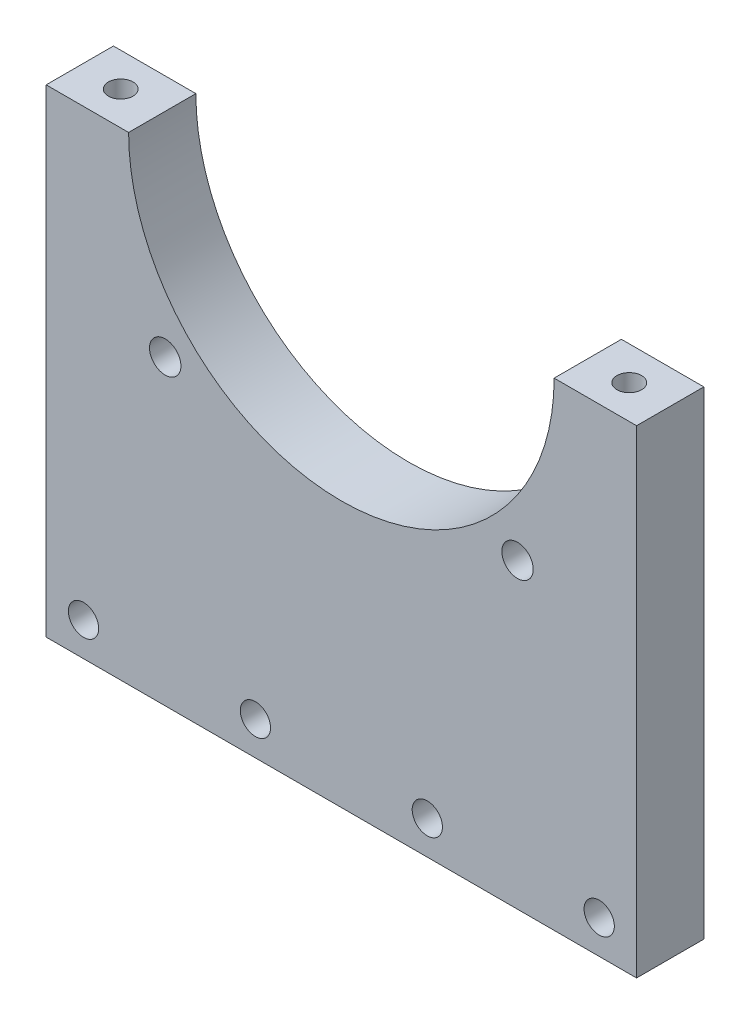
ISO-10303-21;
HEADER;
FILE_DESCRIPTION(('STEP AP214'),'2;1');
FILE_NAME('part.step','',(''),(''),'','','');
FILE_SCHEMA(('AUTOMOTIVE_DESIGN { 1 0 10303 214 1 1 1 1 }'));
ENDSEC;
DATA;
#1=APPLICATION_CONTEXT('core data for automotive mechanical design processes');
#2=APPLICATION_PROTOCOL_DEFINITION('international standard','automotive_design',2000,#1);
#3=PRODUCT_CONTEXT('',#1,'mechanical');
#4=PRODUCT('Part','Part','',(#3));
#5=PRODUCT_RELATED_PRODUCT_CATEGORY('part','',(#4));
#6=PRODUCT_DEFINITION_FORMATION('','',#4);
#7=PRODUCT_DEFINITION_CONTEXT('part definition',#1,'design');
#8=PRODUCT_DEFINITION('design','',#6,#7);
#9=PRODUCT_DEFINITION_SHAPE('','',#8);
#10=(LENGTH_UNIT() NAMED_UNIT(*) SI_UNIT(.MILLI.,.METRE.));
#11=(NAMED_UNIT(*) PLANE_ANGLE_UNIT() SI_UNIT($,.RADIAN.));
#12=(NAMED_UNIT(*) SI_UNIT($,.STERADIAN.) SOLID_ANGLE_UNIT());
#13=UNCERTAINTY_MEASURE_WITH_UNIT(LENGTH_MEASURE(1.E-05),#10,'distance_accuracy_value','');
#14=(GEOMETRIC_REPRESENTATION_CONTEXT(3) GLOBAL_UNCERTAINTY_ASSIGNED_CONTEXT((#13)) GLOBAL_UNIT_ASSIGNED_CONTEXT((#10,
#11,#12)) REPRESENTATION_CONTEXT('',''));
#15=CARTESIAN_POINT('',(0.,0.,0.));
#16=DIRECTION('',(0.,0.,1.));
#17=DIRECTION('',(1.,0.,0.));
#18=AXIS2_PLACEMENT_3D('',#15,#16,#17);
#19=CARTESIAN_POINT('',(0.,-20.,4.5));
#20=DIRECTION('',(0.,1.,0.));
#21=DIRECTION('',(1.,0.,0.));
#22=AXIS2_PLACEMENT_3D('',#19,#20,#21);
#23=PLANE('',#22);
#24=CARTESIAN_POINT('',(34.025,-20.,4.5));
#25=DIRECTION('',(0.,1.,0.));
#26=DIRECTION('',(-1.,0.,0.));
#27=AXIS2_PLACEMENT_3D('',#24,#25,#26);
#28=CIRCLE('',#27,1.65);
#29=CARTESIAN_POINT('',(32.375,-20.,4.5));
#30=VERTEX_POINT('',#29);
#31=EDGE_CURVE('E11',#30,#30,#28,.T.);
#32=ORIENTED_EDGE('',*,*,#31,.T.);
#33=EDGE_LOOP('',(#32));
#34=FACE_BOUND('',#33,.T.);
#35=ADVANCED_FACE('F16',(#34),#23,.T.);
#36=CARTESIAN_POINT('',(34.025,-20.,4.5));
#37=DIRECTION('',(0.,1.,0.));
#38=DIRECTION('',(-1.,0.,0.));
#39=AXIS2_PLACEMENT_3D('',#36,#37,#38);
#40=CYLINDRICAL_SURFACE('',#39,1.65);
#41=CARTESIAN_POINT('',(34.025,0.,4.5));
#42=DIRECTION('',(0.,1.,0.));
#43=DIRECTION('',(-1.,0.,0.));
#44=AXIS2_PLACEMENT_3D('',#41,#42,#43);
#45=CIRCLE('',#44,1.65);
#46=CARTESIAN_POINT('',(32.375,0.,4.5));
#47=VERTEX_POINT('',#46);
#48=EDGE_CURVE('E159',#47,#47,#45,.T.);
#49=ORIENTED_EDGE('',*,*,#48,.T.);
#50=EDGE_LOOP('',(#49));
#51=FACE_BOUND('',#50,.T.);
#52=ORIENTED_EDGE('',*,*,#31,.F.);
#53=EDGE_LOOP('',(#52));
#54=FACE_BOUND('',#53,.T.);
#55=ADVANCED_FACE('F350',(#51,#54),#40,.F.);
#56=CARTESIAN_POINT('',(0.,-20.,4.5));
#57=DIRECTION('',(0.,1.,0.));
#58=DIRECTION('',(1.,0.,0.));
#59=AXIS2_PLACEMENT_3D('',#56,#57,#58);
#60=PLANE('',#59);
#61=CARTESIAN_POINT('',(-34.025,-20.,4.5));
#62=DIRECTION('',(0.,1.,0.));
#63=DIRECTION('',(-1.,0.,0.));
#64=AXIS2_PLACEMENT_3D('',#61,#62,#63);
#65=CIRCLE('',#64,1.65);
#66=CARTESIAN_POINT('',(-35.675,-20.,4.5));
#67=VERTEX_POINT('',#66);
#68=EDGE_CURVE('E26',#67,#67,#65,.T.);
#69=ORIENTED_EDGE('',*,*,#68,.T.);
#70=EDGE_LOOP('',(#69));
#71=FACE_BOUND('',#70,.T.);
#72=ADVANCED_FACE('F366',(#71),#60,.T.);
#73=CARTESIAN_POINT('',(-34.025,-20.,4.5));
#74=DIRECTION('',(0.,1.,0.));
#75=DIRECTION('',(-1.,0.,0.));
#76=AXIS2_PLACEMENT_3D('',#73,#74,#75);
#77=CYLINDRICAL_SURFACE('',#76,1.65);
#78=CARTESIAN_POINT('',(-34.025,0.,4.5));
#79=DIRECTION('',(0.,1.,0.));
#80=DIRECTION('',(-1.,0.,0.));
#81=AXIS2_PLACEMENT_3D('',#78,#79,#80);
#82=CIRCLE('',#81,1.65);
#83=CARTESIAN_POINT('',(-35.675,0.,4.5));
#84=VERTEX_POINT('',#83);
#85=EDGE_CURVE('E174',#84,#84,#82,.T.);
#86=ORIENTED_EDGE('',*,*,#85,.T.);
#87=EDGE_LOOP('',(#86));
#88=FACE_BOUND('',#87,.T.);
#89=ORIENTED_EDGE('',*,*,#68,.F.);
#90=EDGE_LOOP('',(#89));
#91=FACE_BOUND('',#90,.T.);
#92=ADVANCED_FACE('F370',(#88,#91),#77,.F.);
#93=CARTESIAN_POINT('',(0.,-12.25,0.));
#94=DIRECTION('',(0.,0.,1.));
#95=DIRECTION('',(1.,0.,0.));
#96=AXIS2_PLACEMENT_3D('',#93,#94,#95);
#97=PLANE('',#96);
#98=CARTESIAN_POINT('',(11.5,-59.5,0.));
#99=DIRECTION('',(0.,0.,1.));
#100=DIRECTION('',(1.,0.,0.));
#101=AXIS2_PLACEMENT_3D('',#98,#99,#100);
#102=CIRCLE('',#101,2.025);
#103=CARTESIAN_POINT('',(13.525,-59.5,0.));
#104=VERTEX_POINT('',#103);
#105=EDGE_CURVE('E215',#104,#104,#102,.T.);
#106=ORIENTED_EDGE('',*,*,#105,.T.);
#107=EDGE_LOOP('',(#106));
#108=FACE_BOUND('',#107,.T.);
#109=CARTESIAN_POINT('',(-34.5,-59.5,0.));
#110=DIRECTION('',(0.,0.,1.));
#111=DIRECTION('',(1.,0.,0.));
#112=AXIS2_PLACEMENT_3D('',#109,#110,#111);
#113=CIRCLE('',#112,2.025);
#114=CARTESIAN_POINT('',(-32.475,-59.5,0.));
#115=VERTEX_POINT('',#114);
#116=EDGE_CURVE('E144',#115,#115,#113,.T.);
#117=ORIENTED_EDGE('',*,*,#116,.T.);
#118=EDGE_LOOP('',(#117));
#119=FACE_BOUND('',#118,.T.);
#120=CARTESIAN_POINT('',(34.5,-59.5,0.));
#121=DIRECTION('',(0.,0.,1.));
#122=DIRECTION('',(1.,0.,0.));
#123=AXIS2_PLACEMENT_3D('',#120,#121,#122);
#124=CIRCLE('',#123,2.025);
#125=CARTESIAN_POINT('',(36.525,-59.5,0.));
#126=VERTEX_POINT('',#125);
#127=EDGE_CURVE('E170',#126,#126,#124,.T.);
#128=ORIENTED_EDGE('',*,*,#127,.T.);
#129=EDGE_LOOP('',(#128));
#130=FACE_BOUND('',#129,.T.);
#131=CARTESIAN_POINT('',(-11.5,-59.5,0.));
#132=DIRECTION('',(0.,0.,-1.));
#133=DIRECTION('',(1.,0.,0.));
#134=AXIS2_PLACEMENT_3D('',#131,#132,#133);
#135=CIRCLE('',#134,2.025);
#136=CARTESIAN_POINT('',(-9.475,-59.5,0.));
#137=VERTEX_POINT('',#136);
#138=EDGE_CURVE('E169',#137,#137,#135,.T.);
#139=ORIENTED_EDGE('',*,*,#138,.F.);
#140=EDGE_LOOP('',(#139));
#141=FACE_BOUND('',#140,.T.);
#142=DIRECTION('',(0.,-1.,0.));
#143=VECTOR('',#142,1.);
#144=CARTESIAN_POINT('',(-39.5,-27.5,0.));
#145=LINE('',#144,#143);
#146=CARTESIAN_POINT('',(-39.5,0.,0.));
#147=VERTEX_POINT('',#146);
#148=CARTESIAN_POINT('',(-39.5,-64.,0.));
#149=VERTEX_POINT('',#148);
#150=EDGE_CURVE('E237',#147,#149,#145,.T.);
#151=ORIENTED_EDGE('',*,*,#150,.F.);
#152=DIRECTION('',(1.,0.,0.));
#153=VECTOR('',#152,1.);
#154=CARTESIAN_POINT('',(-34.025,0.,0.));
#155=LINE('',#154,#153);
#156=CARTESIAN_POINT('',(-28.47,0.,0.));
#157=VERTEX_POINT('',#156);
#158=EDGE_CURVE('E175',#147,#157,#155,.T.);
#159=ORIENTED_EDGE('',*,*,#158,.T.);
#160=CARTESIAN_POINT('',(0.,0.,0.));
#161=DIRECTION('',(0.,0.,1.));
#162=DIRECTION('',(1.,0.,0.));
#163=AXIS2_PLACEMENT_3D('',#160,#161,#162);
#164=CIRCLE('',#163,28.47);
#165=CARTESIAN_POINT('',(28.47,0.,0.));
#166=VERTEX_POINT('',#165);
#167=EDGE_CURVE('E204',#157,#166,#164,.T.);
#168=ORIENTED_EDGE('',*,*,#167,.T.);
#169=DIRECTION('',(-1.,0.,0.));
#170=VECTOR('',#169,1.);
#171=CARTESIAN_POINT('',(34.025,0.,0.));
#172=LINE('',#171,#170);
#173=CARTESIAN_POINT('',(39.5,0.,0.));
#174=VERTEX_POINT('',#173);
#175=EDGE_CURVE('E193',#174,#166,#172,.T.);
#176=ORIENTED_EDGE('',*,*,#175,.F.);
#177=DIRECTION('',(0.,1.,0.));
#178=VECTOR('',#177,1.);
#179=CARTESIAN_POINT('',(39.5,-27.5,0.));
#180=LINE('',#179,#178);
#181=CARTESIAN_POINT('',(39.5,-64.,0.));
#182=VERTEX_POINT('',#181);
#183=EDGE_CURVE('E161',#182,#174,#180,.T.);
#184=ORIENTED_EDGE('',*,*,#183,.F.);
#185=DIRECTION('',(-1.,0.,0.));
#186=VECTOR('',#185,1.);
#187=CARTESIAN_POINT('',(0.,-64.,0.));
#188=LINE('',#187,#186);
#189=EDGE_CURVE('E203',#182,#149,#188,.T.);
#190=ORIENTED_EDGE('',*,*,#189,.T.);
#191=EDGE_LOOP('',(#151,#159,#168,#176,#184,#190));
#192=FACE_BOUND('',#191,.T.);
#193=CARTESIAN_POINT('',(-23.57,-23.57,0.));
#194=DIRECTION('',(0.,0.,1.));
#195=DIRECTION('',(1.,0.,0.));
#196=AXIS2_PLACEMENT_3D('',#193,#194,#195);
#197=CIRCLE('',#196,2.1);
#198=CARTESIAN_POINT('',(-21.47,-23.57,0.));
#199=VERTEX_POINT('',#198);
#200=EDGE_CURVE('E176',#199,#199,#197,.T.);
#201=ORIENTED_EDGE('',*,*,#200,.T.);
#202=EDGE_LOOP('',(#201));
#203=FACE_BOUND('',#202,.T.);
#204=CARTESIAN_POINT('',(23.57,-23.57,0.));
#205=DIRECTION('',(0.,0.,1.));
#206=DIRECTION('',(1.,0.,0.));
#207=AXIS2_PLACEMENT_3D('',#204,#205,#206);
#208=CIRCLE('',#207,2.1);
#209=CARTESIAN_POINT('',(25.67,-23.57,0.));
#210=VERTEX_POINT('',#209);
#211=EDGE_CURVE('E207',#210,#210,#208,.T.);
#212=ORIENTED_EDGE('',*,*,#211,.T.);
#213=EDGE_LOOP('',(#212));
#214=FACE_BOUND('',#213,.T.);
#215=ADVANCED_FACE('F263',(#108,#119,#130,#141,#192,#203,#214),#97,.F.);
#216=CARTESIAN_POINT('',(0.,-12.25,9.));
#217=DIRECTION('',(0.,0.,1.));
#218=DIRECTION('',(1.,0.,0.));
#219=AXIS2_PLACEMENT_3D('',#216,#217,#218);
#220=PLANE('',#219);
#221=CARTESIAN_POINT('',(11.5,-59.5,9.));
#222=DIRECTION('',(0.,0.,1.));
#223=DIRECTION('',(1.,0.,0.));
#224=AXIS2_PLACEMENT_3D('',#221,#222,#223);
#225=CIRCLE('',#224,2.025);
#226=CARTESIAN_POINT('',(13.525,-59.5,9.));
#227=VERTEX_POINT('',#226);
#228=EDGE_CURVE('E210',#227,#227,#225,.T.);
#229=ORIENTED_EDGE('',*,*,#228,.F.);
#230=EDGE_LOOP('',(#229));
#231=FACE_BOUND('',#230,.T.);
#232=CARTESIAN_POINT('',(-34.5,-59.5,9.));
#233=DIRECTION('',(0.,0.,1.));
#234=DIRECTION('',(1.,0.,0.));
#235=AXIS2_PLACEMENT_3D('',#232,#233,#234);
#236=CIRCLE('',#235,2.025);
#237=CARTESIAN_POINT('',(-32.475,-59.5,9.));
#238=VERTEX_POINT('',#237);
#239=EDGE_CURVE('E140',#238,#238,#236,.T.);
#240=ORIENTED_EDGE('',*,*,#239,.F.);
#241=EDGE_LOOP('',(#240));
#242=FACE_BOUND('',#241,.T.);
#243=CARTESIAN_POINT('',(34.5,-59.5,9.));
#244=DIRECTION('',(0.,0.,1.));
#245=DIRECTION('',(1.,0.,0.));
#246=AXIS2_PLACEMENT_3D('',#243,#244,#245);
#247=CIRCLE('',#246,2.025);
#248=CARTESIAN_POINT('',(36.525,-59.5,9.));
#249=VERTEX_POINT('',#248);
#250=EDGE_CURVE('E152',#249,#249,#247,.T.);
#251=ORIENTED_EDGE('',*,*,#250,.F.);
#252=EDGE_LOOP('',(#251));
#253=FACE_BOUND('',#252,.T.);
#254=CARTESIAN_POINT('',(-11.5,-59.5,9.));
#255=DIRECTION('',(0.,0.,-1.));
#256=DIRECTION('',(1.,0.,0.));
#257=AXIS2_PLACEMENT_3D('',#254,#255,#256);
#258=CIRCLE('',#257,2.025);
#259=CARTESIAN_POINT('',(-9.475,-59.5,9.));
#260=VERTEX_POINT('',#259);
#261=EDGE_CURVE('E166',#260,#260,#258,.T.);
#262=ORIENTED_EDGE('',*,*,#261,.T.);
#263=EDGE_LOOP('',(#262));
#264=FACE_BOUND('',#263,.T.);
#265=DIRECTION('',(0.,-1.,0.));
#266=VECTOR('',#265,1.);
#267=CARTESIAN_POINT('',(-39.5,-27.5,9.));
#268=LINE('',#267,#266);
#269=CARTESIAN_POINT('',(-39.5,0.,9.));
#270=VERTEX_POINT('',#269);
#271=CARTESIAN_POINT('',(-39.5,-64.,9.));
#272=VERTEX_POINT('',#271);
#273=EDGE_CURVE('E183',#270,#272,#268,.T.);
#274=ORIENTED_EDGE('',*,*,#273,.T.);
#275=DIRECTION('',(-1.,0.,0.));
#276=VECTOR('',#275,1.);
#277=CARTESIAN_POINT('',(0.,-64.,9.));
#278=LINE('',#277,#276);
#279=CARTESIAN_POINT('',(39.5,-64.,9.));
#280=VERTEX_POINT('',#279);
#281=EDGE_CURVE('E164',#280,#272,#278,.T.);
#282=ORIENTED_EDGE('',*,*,#281,.F.);
#283=DIRECTION('',(0.,1.,0.));
#284=VECTOR('',#283,1.);
#285=CARTESIAN_POINT('',(39.5,-27.5,9.));
#286=LINE('',#285,#284);
#287=CARTESIAN_POINT('',(39.5,0.,9.));
#288=VERTEX_POINT('',#287);
#289=EDGE_CURVE('E189',#280,#288,#286,.T.);
#290=ORIENTED_EDGE('',*,*,#289,.T.);
#291=DIRECTION('',(-1.,0.,0.));
#292=VECTOR('',#291,1.);
#293=CARTESIAN_POINT('',(34.025,0.,9.));
#294=LINE('',#293,#292);
#295=CARTESIAN_POINT('',(28.47,0.,9.));
#296=VERTEX_POINT('',#295);
#297=EDGE_CURVE('E194',#288,#296,#294,.T.);
#298=ORIENTED_EDGE('',*,*,#297,.T.);
#299=CARTESIAN_POINT('',(0.,0.,9.));
#300=DIRECTION('',(0.,0.,1.));
#301=DIRECTION('',(1.,0.,0.));
#302=AXIS2_PLACEMENT_3D('',#299,#300,#301);
#303=CIRCLE('',#302,28.47);
#304=CARTESIAN_POINT('',(-28.47,0.,9.));
#305=VERTEX_POINT('',#304);
#306=EDGE_CURVE('E145',#305,#296,#303,.T.);
#307=ORIENTED_EDGE('',*,*,#306,.F.);
#308=DIRECTION('',(1.,0.,0.));
#309=VECTOR('',#308,1.);
#310=CARTESIAN_POINT('',(-34.025,0.,9.));
#311=LINE('',#310,#309);
#312=EDGE_CURVE('E171',#270,#305,#311,.T.);
#313=ORIENTED_EDGE('',*,*,#312,.F.);
#314=EDGE_LOOP('',(#274,#282,#290,#298,#307,#313));
#315=FACE_BOUND('',#314,.T.);
#316=CARTESIAN_POINT('',(-23.57,-23.57,9.));
#317=DIRECTION('',(0.,0.,1.));
#318=DIRECTION('',(1.,0.,0.));
#319=AXIS2_PLACEMENT_3D('',#316,#317,#318);
#320=CIRCLE('',#319,2.1);
#321=CARTESIAN_POINT('',(-21.47,-23.57,9.));
#322=VERTEX_POINT('',#321);
#323=EDGE_CURVE('E179',#322,#322,#320,.T.);
#324=ORIENTED_EDGE('',*,*,#323,.F.);
#325=EDGE_LOOP('',(#324));
#326=FACE_BOUND('',#325,.T.);
#327=CARTESIAN_POINT('',(23.57,-23.57,9.));
#328=DIRECTION('',(0.,0.,1.));
#329=DIRECTION('',(1.,0.,0.));
#330=AXIS2_PLACEMENT_3D('',#327,#328,#329);
#331=CIRCLE('',#330,2.1);
#332=CARTESIAN_POINT('',(25.67,-23.57,9.));
#333=VERTEX_POINT('',#332);
#334=EDGE_CURVE('E178',#333,#333,#331,.T.);
#335=ORIENTED_EDGE('',*,*,#334,.F.);
#336=EDGE_LOOP('',(#335));
#337=FACE_BOUND('',#336,.T.);
#338=ADVANCED_FACE('F271',(#231,#242,#253,#264,#315,#326,#337),#220,.T.);
#339=CARTESIAN_POINT('',(11.5,-59.5,9.));
#340=DIRECTION('',(0.,0.,-1.));
#341=DIRECTION('',(-1.,0.,0.));
#342=AXIS2_PLACEMENT_3D('',#339,#340,#341);
#343=CYLINDRICAL_SURFACE('',#342,2.025);
#344=ORIENTED_EDGE('',*,*,#105,.F.);
#345=EDGE_LOOP('',(#344));
#346=FACE_BOUND('',#345,.T.);
#347=ORIENTED_EDGE('',*,*,#228,.T.);
#348=EDGE_LOOP('',(#347));
#349=FACE_BOUND('',#348,.T.);
#350=ADVANCED_FACE('F384',(#346,#349),#343,.F.);
#351=CARTESIAN_POINT('',(23.57,-23.57,9.));
#352=DIRECTION('',(0.,0.,-1.));
#353=DIRECTION('',(-1.,0.,0.));
#354=AXIS2_PLACEMENT_3D('',#351,#352,#353);
#355=CYLINDRICAL_SURFACE('',#354,2.1);
#356=ORIENTED_EDGE('',*,*,#211,.F.);
#357=EDGE_LOOP('',(#356));
#358=FACE_BOUND('',#357,.T.);
#359=ORIENTED_EDGE('',*,*,#334,.T.);
#360=EDGE_LOOP('',(#359));
#361=FACE_BOUND('',#360,.T.);
#362=ADVANCED_FACE('F382',(#358,#361),#355,.F.);
#363=CARTESIAN_POINT('',(-23.57,-23.57,9.));
#364=DIRECTION('',(0.,0.,-1.));
#365=DIRECTION('',(-1.,0.,0.));
#366=AXIS2_PLACEMENT_3D('',#363,#364,#365);
#367=CYLINDRICAL_SURFACE('',#366,2.1);
#368=ORIENTED_EDGE('',*,*,#200,.F.);
#369=EDGE_LOOP('',(#368));
#370=FACE_BOUND('',#369,.T.);
#371=ORIENTED_EDGE('',*,*,#323,.T.);
#372=EDGE_LOOP('',(#371));
#373=FACE_BOUND('',#372,.T.);
#374=ADVANCED_FACE('F378',(#370,#373),#367,.F.);
#375=CARTESIAN_POINT('',(-34.025,0.,9.));
#376=DIRECTION('',(0.,1.,0.));
#377=DIRECTION('',(1.,0.,0.));
#378=AXIS2_PLACEMENT_3D('',#375,#376,#377);
#379=PLANE('',#378);
#380=ORIENTED_EDGE('',*,*,#85,.F.);
#381=EDGE_LOOP('',(#380));
#382=FACE_BOUND('',#381,.T.);
#383=ORIENTED_EDGE('',*,*,#158,.F.);
#384=DIRECTION('',(0.,0.,-1.));
#385=VECTOR('',#384,1.);
#386=CARTESIAN_POINT('',(-39.5,0.,9.));
#387=LINE('',#386,#385);
#388=EDGE_CURVE('E187',#270,#147,#387,.T.);
#389=ORIENTED_EDGE('',*,*,#388,.F.);
#390=ORIENTED_EDGE('',*,*,#312,.T.);
#391=DIRECTION('',(0.,0.,-1.));
#392=VECTOR('',#391,1.);
#393=CARTESIAN_POINT('',(-28.47,0.,9.));
#394=LINE('',#393,#392);
#395=EDGE_CURVE('E155',#305,#157,#394,.T.);
#396=ORIENTED_EDGE('',*,*,#395,.T.);
#397=EDGE_LOOP('',(#383,#389,#390,#396));
#398=FACE_BOUND('',#397,.T.);
#399=ADVANCED_FACE('F381',(#382,#398),#379,.T.);
#400=CARTESIAN_POINT('',(-11.5,-59.5,9.));
#401=DIRECTION('',(0.,0.,-1.));
#402=DIRECTION('',(-1.,0.,0.));
#403=AXIS2_PLACEMENT_3D('',#400,#401,#402);
#404=CYLINDRICAL_SURFACE('',#403,2.025);
#405=ORIENTED_EDGE('',*,*,#138,.T.);
#406=EDGE_LOOP('',(#405));
#407=FACE_BOUND('',#406,.T.);
#408=ORIENTED_EDGE('',*,*,#261,.F.);
#409=EDGE_LOOP('',(#408));
#410=FACE_BOUND('',#409,.T.);
#411=ADVANCED_FACE('F374',(#407,#410),#404,.F.);
#412=CARTESIAN_POINT('',(34.5,-59.5,9.));
#413=DIRECTION('',(0.,0.,-1.));
#414=DIRECTION('',(-1.,0.,0.));
#415=AXIS2_PLACEMENT_3D('',#412,#413,#414);
#416=CYLINDRICAL_SURFACE('',#415,2.025);
#417=ORIENTED_EDGE('',*,*,#127,.F.);
#418=EDGE_LOOP('',(#417));
#419=FACE_BOUND('',#418,.T.);
#420=ORIENTED_EDGE('',*,*,#250,.T.);
#421=EDGE_LOOP('',(#420));
#422=FACE_BOUND('',#421,.T.);
#423=ADVANCED_FACE('F403',(#419,#422),#416,.F.);
#424=CARTESIAN_POINT('',(-34.5,-59.5,9.));
#425=DIRECTION('',(0.,0.,-1.));
#426=DIRECTION('',(-1.,0.,0.));
#427=AXIS2_PLACEMENT_3D('',#424,#425,#426);
#428=CYLINDRICAL_SURFACE('',#427,2.025);
#429=ORIENTED_EDGE('',*,*,#116,.F.);
#430=EDGE_LOOP('',(#429));
#431=FACE_BOUND('',#430,.T.);
#432=ORIENTED_EDGE('',*,*,#239,.T.);
#433=EDGE_LOOP('',(#432));
#434=FACE_BOUND('',#433,.T.);
#435=ADVANCED_FACE('F141',(#431,#434),#428,.F.);
#436=CARTESIAN_POINT('',(0.,0.,9.));
#437=DIRECTION('',(0.,0.,-1.));
#438=DIRECTION('',(-1.,0.,0.));
#439=AXIS2_PLACEMENT_3D('',#436,#437,#438);
#440=CYLINDRICAL_SURFACE('',#439,28.47);
#441=ORIENTED_EDGE('',*,*,#167,.F.);
#442=ORIENTED_EDGE('',*,*,#395,.F.);
#443=ORIENTED_EDGE('',*,*,#306,.T.);
#444=DIRECTION('',(0.,0.,-1.));
#445=VECTOR('',#444,1.);
#446=CARTESIAN_POINT('',(28.47,0.,9.));
#447=LINE('',#446,#445);
#448=EDGE_CURVE('E198',#296,#166,#447,.T.);
#449=ORIENTED_EDGE('',*,*,#448,.T.);
#450=EDGE_LOOP('',(#441,#442,#443,#449));
#451=FACE_BOUND('',#450,.T.);
#452=ADVANCED_FACE('F268',(#451),#440,.F.);
#453=CARTESIAN_POINT('',(34.025,0.,9.));
#454=DIRECTION('',(0.,-1.,0.));
#455=DIRECTION('',(0.,0.,-1.));
#456=AXIS2_PLACEMENT_3D('',#453,#454,#455);
#457=PLANE('',#456);
#458=ORIENTED_EDGE('',*,*,#48,.F.);
#459=EDGE_LOOP('',(#458));
#460=FACE_BOUND('',#459,.T.);
#461=ORIENTED_EDGE('',*,*,#175,.T.);
#462=ORIENTED_EDGE('',*,*,#448,.F.);
#463=ORIENTED_EDGE('',*,*,#297,.F.);
#464=DIRECTION('',(0.,0.,-1.));
#465=VECTOR('',#464,1.);
#466=CARTESIAN_POINT('',(39.5,0.,9.));
#467=LINE('',#466,#465);
#468=EDGE_CURVE('E19',#288,#174,#467,.T.);
#469=ORIENTED_EDGE('',*,*,#468,.T.);
#470=EDGE_LOOP('',(#461,#462,#463,#469));
#471=FACE_BOUND('',#470,.T.);
#472=ADVANCED_FACE('F259',(#460,#471),#457,.F.);
#473=CARTESIAN_POINT('',(39.5,-27.5,9.));
#474=DIRECTION('',(-1.,0.,0.));
#475=DIRECTION('',(0.,1.,0.));
#476=AXIS2_PLACEMENT_3D('',#473,#474,#475);
#477=PLANE('',#476);
#478=ORIENTED_EDGE('',*,*,#183,.T.);
#479=ORIENTED_EDGE('',*,*,#468,.F.);
#480=ORIENTED_EDGE('',*,*,#289,.F.);
#481=DIRECTION('',(0.,0.,-1.));
#482=VECTOR('',#481,1.);
#483=CARTESIAN_POINT('',(39.5,-64.,9.));
#484=LINE('',#483,#482);
#485=EDGE_CURVE('E222',#280,#182,#484,.T.);
#486=ORIENTED_EDGE('',*,*,#485,.T.);
#487=EDGE_LOOP('',(#478,#479,#480,#486));
#488=FACE_BOUND('',#487,.T.);
#489=ADVANCED_FACE('F277',(#488),#477,.F.);
#490=CARTESIAN_POINT('',(0.,-64.,9.));
#491=DIRECTION('',(0.,-1.,0.));
#492=DIRECTION('',(0.,0.,-1.));
#493=AXIS2_PLACEMENT_3D('',#490,#491,#492);
#494=PLANE('',#493);
#495=ORIENTED_EDGE('',*,*,#189,.F.);
#496=ORIENTED_EDGE('',*,*,#485,.F.);
#497=ORIENTED_EDGE('',*,*,#281,.T.);
#498=DIRECTION('',(0.,0.,-1.));
#499=VECTOR('',#498,1.);
#500=CARTESIAN_POINT('',(-39.5,-64.,9.));
#501=LINE('',#500,#499);
#502=EDGE_CURVE('E188',#272,#149,#501,.T.);
#503=ORIENTED_EDGE('',*,*,#502,.T.);
#504=EDGE_LOOP('',(#495,#496,#497,#503));
#505=FACE_BOUND('',#504,.T.);
#506=ADVANCED_FACE('F359',(#505),#494,.T.);
#507=CARTESIAN_POINT('',(-39.5,-27.5,9.));
#508=DIRECTION('',(1.,0.,0.));
#509=DIRECTION('',(0.,1.,0.));
#510=AXIS2_PLACEMENT_3D('',#507,#508,#509);
#511=PLANE('',#510);
#512=ORIENTED_EDGE('',*,*,#150,.T.);
#513=ORIENTED_EDGE('',*,*,#502,.F.);
#514=ORIENTED_EDGE('',*,*,#273,.F.);
#515=ORIENTED_EDGE('',*,*,#388,.T.);
#516=EDGE_LOOP('',(#512,#513,#514,#515));
#517=FACE_BOUND('',#516,.T.);
#518=ADVANCED_FACE('F387',(#517),#511,.F.);
#519=CLOSED_SHELL('',(#35,#55,#72,#92,#215,#338,#350,#362,#374,#399,#411,#423,#435,#452,#472,
#489,#506,#518));
#520=MANIFOLD_SOLID_BREP('B1',#519);
#521=ADVANCED_BREP_SHAPE_REPRESENTATION('',(#18,#520),#14);
#522=SHAPE_DEFINITION_REPRESENTATION(#9,#521);
ENDSEC;
END-ISO-10303-21;
